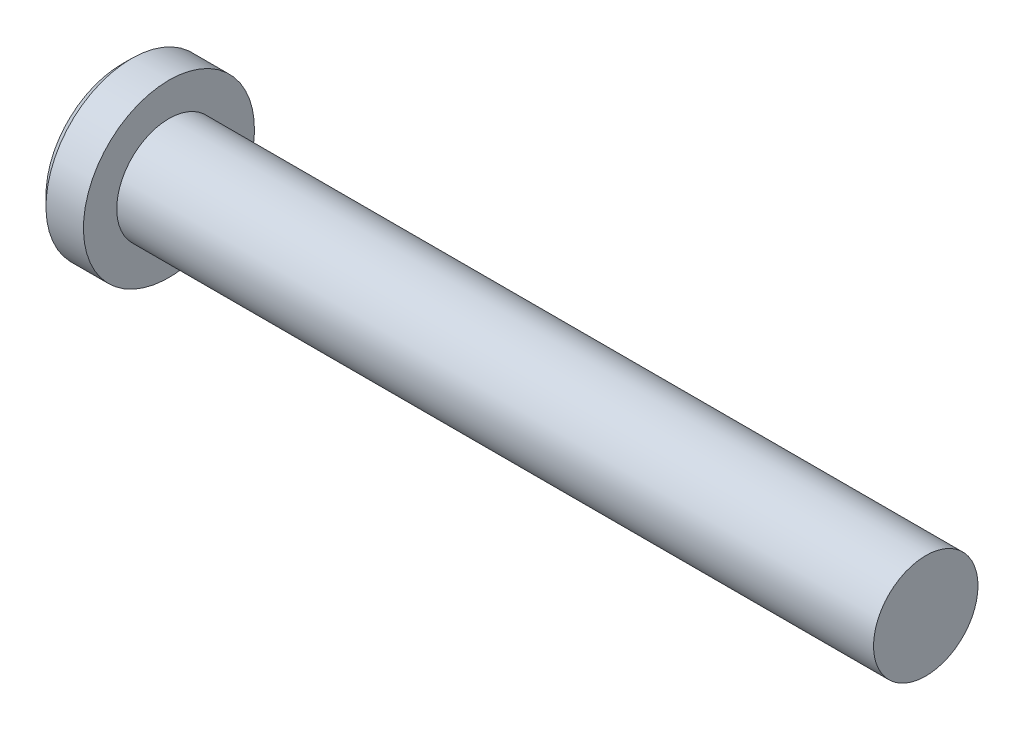
ISO-10303-21;
HEADER;
FILE_DESCRIPTION(('STEP AP214'),'2;1');
FILE_NAME('part.step','',(''),(''),'','','');
FILE_SCHEMA(('AUTOMOTIVE_DESIGN { 1 0 10303 214 1 1 1 1 }'));
ENDSEC;
DATA;
#1=APPLICATION_CONTEXT('core data for automotive mechanical design processes');
#2=APPLICATION_PROTOCOL_DEFINITION('international standard','automotive_design',2000,#1);
#3=PRODUCT_CONTEXT('',#1,'mechanical');
#4=PRODUCT('Part','Part','',(#3));
#5=PRODUCT_RELATED_PRODUCT_CATEGORY('part','',(#4));
#6=PRODUCT_DEFINITION_FORMATION('','',#4);
#7=PRODUCT_DEFINITION_CONTEXT('part definition',#1,'design');
#8=PRODUCT_DEFINITION('design','',#6,#7);
#9=PRODUCT_DEFINITION_SHAPE('','',#8);
#10=(LENGTH_UNIT() NAMED_UNIT(*) SI_UNIT(.MILLI.,.METRE.));
#11=(NAMED_UNIT(*) PLANE_ANGLE_UNIT() SI_UNIT($,.RADIAN.));
#12=(NAMED_UNIT(*) SI_UNIT($,.STERADIAN.) SOLID_ANGLE_UNIT());
#13=UNCERTAINTY_MEASURE_WITH_UNIT(LENGTH_MEASURE(1.E-05),#10,'distance_accuracy_value','');
#14=(GEOMETRIC_REPRESENTATION_CONTEXT(3) GLOBAL_UNCERTAINTY_ASSIGNED_CONTEXT((#13)) GLOBAL_UNIT_ASSIGNED_CONTEXT((#10,
#11,#12)) REPRESENTATION_CONTEXT('',''));
#15=CARTESIAN_POINT('',(0.,0.,0.));
#16=DIRECTION('',(0.,0.,1.));
#17=DIRECTION('',(1.,0.,0.));
#18=AXIS2_PLACEMENT_3D('',#15,#16,#17);
#19=CARTESIAN_POINT('',(-12.7,0.,0.));
#20=DIRECTION('',(1.,0.,0.));
#21=DIRECTION('',(0.,0.,-1.));
#22=AXIS2_PLACEMENT_3D('',#19,#20,#21);
#23=CYLINDRICAL_SURFACE('',#22,1.7526);
#24=CARTESIAN_POINT('',(-12.7,0.,0.));
#25=DIRECTION('',(1.,0.,0.));
#26=DIRECTION('',(0.,1.,0.));
#27=AXIS2_PLACEMENT_3D('',#24,#25,#26);
#28=CIRCLE('',#27,1.7526);
#29=CARTESIAN_POINT('',(-12.7,1.75259999999999,0.));
#30=VERTEX_POINT('',#29);
#31=EDGE_CURVE('E41',#30,#30,#28,.F.);
#32=ORIENTED_EDGE('',*,*,#31,.F.);
#33=EDGE_LOOP('',(#32));
#34=FACE_BOUND('',#33,.T.);
#35=CARTESIAN_POINT('',(12.7,0.,0.));
#36=DIRECTION('',(1.,0.,0.));
#37=DIRECTION('',(0.,0.,-1.));
#38=AXIS2_PLACEMENT_3D('',#35,#36,#37);
#39=CIRCLE('',#38,1.7526);
#40=CARTESIAN_POINT('',(12.7,0.,-1.7526));
#41=VERTEX_POINT('',#40);
#42=EDGE_CURVE('E10',#41,#41,#39,.T.);
#43=ORIENTED_EDGE('',*,*,#42,.F.);
#44=EDGE_LOOP('',(#43));
#45=FACE_BOUND('',#44,.T.);
#46=ADVANCED_FACE('F35',(#34,#45),#23,.T.);
#47=CARTESIAN_POINT('',(12.7,0.,0.));
#48=DIRECTION('',(1.,0.,0.));
#49=DIRECTION('',(0.,0.,-1.));
#50=AXIS2_PLACEMENT_3D('',#47,#48,#49);
#51=PLANE('',#50);
#52=ORIENTED_EDGE('',*,*,#42,.T.);
#53=EDGE_LOOP('',(#52));
#54=FACE_BOUND('',#53,.T.);
#55=ADVANCED_FACE('F63',(#54),#51,.T.);
#56=CARTESIAN_POINT('',(-12.7,0.,0.));
#57=DIRECTION('',(1.,0.,0.));
#58=DIRECTION('',(0.,1.,0.));
#59=AXIS2_PLACEMENT_3D('',#56,#57,#58);
#60=CYLINDRICAL_SURFACE('',#59,2.8702);
#61=CARTESIAN_POINT('',(-13.9573,0.,0.));
#62=DIRECTION('',(1.,0.,0.));
#63=DIRECTION('',(0.,1.,0.));
#64=AXIS2_PLACEMENT_3D('',#61,#62,#63);
#65=CIRCLE('',#64,2.8702);
#66=CARTESIAN_POINT('',(-13.9573,2.8702,0.));
#67=VERTEX_POINT('',#66);
#68=EDGE_CURVE('E45',#67,#67,#65,.T.);
#69=ORIENTED_EDGE('',*,*,#68,.T.);
#70=EDGE_LOOP('',(#69));
#71=FACE_BOUND('',#70,.T.);
#72=CARTESIAN_POINT('',(-12.7,0.,0.));
#73=DIRECTION('',(1.,0.,0.));
#74=DIRECTION('',(0.,1.,0.));
#75=AXIS2_PLACEMENT_3D('',#72,#73,#74);
#76=CIRCLE('',#75,2.8702);
#77=CARTESIAN_POINT('',(-12.7,2.8702,0.));
#78=VERTEX_POINT('',#77);
#79=EDGE_CURVE('E54',#78,#78,#76,.T.);
#80=ORIENTED_EDGE('',*,*,#79,.F.);
#81=EDGE_LOOP('',(#80));
#82=FACE_BOUND('',#81,.T.);
#83=ADVANCED_FACE('F60',(#71,#82),#60,.T.);
#84=CARTESIAN_POINT('',(-13.9573,0.,0.));
#85=DIRECTION('',(1.,0.,0.));
#86=DIRECTION('',(0.,1.,0.));
#87=AXIS2_PLACEMENT_3D('',#84,#85,#86);
#88=CONICAL_SURFACE('',#87,2.8702,0.785398163397453);
#89=CARTESIAN_POINT('',(-14.2875,0.,0.));
#90=DIRECTION('',(1.,0.,0.));
#91=DIRECTION('',(0.,1.,0.));
#92=AXIS2_PLACEMENT_3D('',#89,#90,#91);
#93=CIRCLE('',#92,2.54);
#94=CARTESIAN_POINT('',(-14.2875,2.54,0.));
#95=VERTEX_POINT('',#94);
#96=EDGE_CURVE('E49',#95,#95,#93,.T.);
#97=ORIENTED_EDGE('',*,*,#96,.T.);
#98=EDGE_LOOP('',(#97));
#99=FACE_BOUND('',#98,.T.);
#100=ORIENTED_EDGE('',*,*,#68,.F.);
#101=EDGE_LOOP('',(#100));
#102=FACE_BOUND('',#101,.T.);
#103=ADVANCED_FACE('F62',(#99,#102),#88,.T.);
#104=CARTESIAN_POINT('',(-14.2875,2.54,0.));
#105=DIRECTION('',(-1.,0.,0.));
#106=DIRECTION('',(0.,-1.,0.));
#107=AXIS2_PLACEMENT_3D('',#104,#105,#106);
#108=PLANE('',#107);
#109=ORIENTED_EDGE('',*,*,#96,.F.);
#110=EDGE_LOOP('',(#109));
#111=FACE_BOUND('',#110,.T.);
#112=ADVANCED_FACE('F70',(#111),#108,.T.);
#113=CARTESIAN_POINT('',(-12.7,2.8702,0.));
#114=DIRECTION('',(1.,0.,0.));
#115=DIRECTION('',(0.,1.,0.));
#116=AXIS2_PLACEMENT_3D('',#113,#114,#115);
#117=PLANE('',#116);
#118=ORIENTED_EDGE('',*,*,#31,.T.);
#119=EDGE_LOOP('',(#118));
#120=FACE_BOUND('',#119,.T.);
#121=ORIENTED_EDGE('',*,*,#79,.T.);
#122=EDGE_LOOP('',(#121));
#123=FACE_BOUND('',#122,.T.);
#124=ADVANCED_FACE('F58',(#120,#123),#117,.T.);
#125=CLOSED_SHELL('',(#46,#55,#83,#103,#112,#124));
#126=MANIFOLD_SOLID_BREP('B2',#125);
#127=ADVANCED_BREP_SHAPE_REPRESENTATION('',(#18,#126),#14);
#128=SHAPE_DEFINITION_REPRESENTATION(#9,#127);
ENDSEC;
END-ISO-10303-21;
